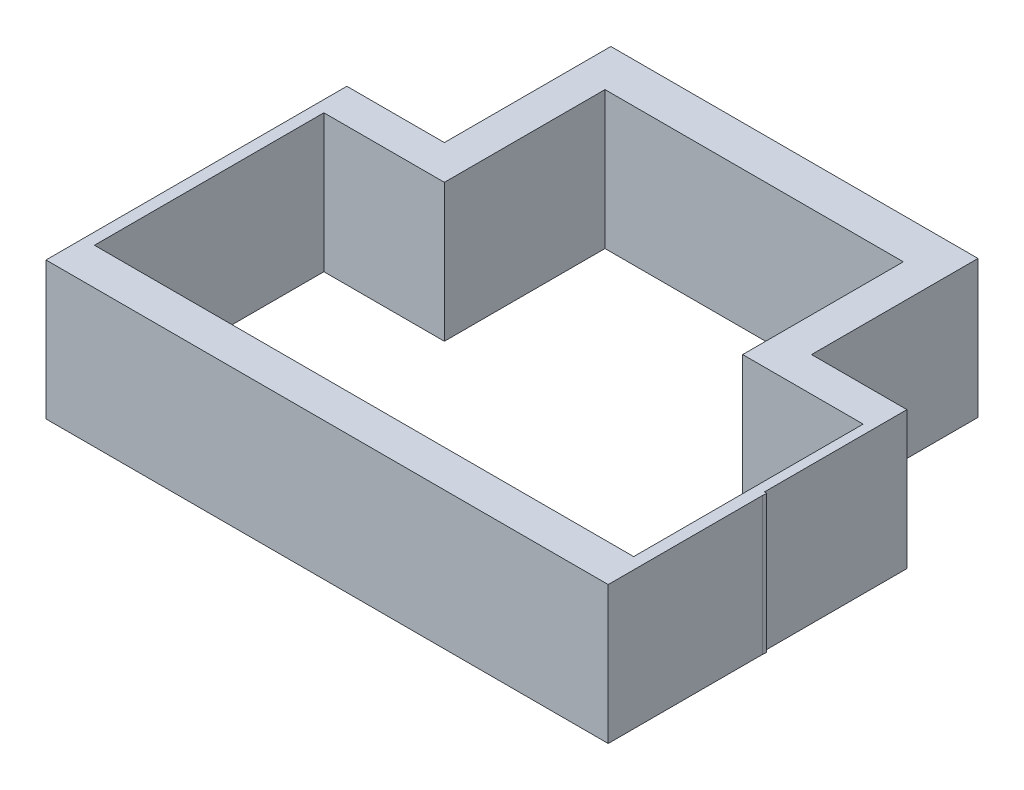
ISO-10303-21;
HEADER;
FILE_DESCRIPTION(('STEP AP214'),'2;1');
FILE_NAME('part.step','',(''),(''),'','','');
FILE_SCHEMA(('AUTOMOTIVE_DESIGN { 1 0 10303 214 1 1 1 1 }'));
ENDSEC;
DATA;
#1=APPLICATION_CONTEXT('core data for automotive mechanical design processes');
#2=APPLICATION_PROTOCOL_DEFINITION('international standard','automotive_design',2000,#1);
#3=PRODUCT_CONTEXT('',#1,'mechanical');
#4=PRODUCT('Part','Part','',(#3));
#5=PRODUCT_RELATED_PRODUCT_CATEGORY('part','',(#4));
#6=PRODUCT_DEFINITION_FORMATION('','',#4);
#7=PRODUCT_DEFINITION_CONTEXT('part definition',#1,'design');
#8=PRODUCT_DEFINITION('design','',#6,#7);
#9=PRODUCT_DEFINITION_SHAPE('','',#8);
#10=(LENGTH_UNIT() NAMED_UNIT(*) SI_UNIT(.MILLI.,.METRE.));
#11=(NAMED_UNIT(*) PLANE_ANGLE_UNIT() SI_UNIT($,.RADIAN.));
#12=(NAMED_UNIT(*) SI_UNIT($,.STERADIAN.) SOLID_ANGLE_UNIT());
#13=UNCERTAINTY_MEASURE_WITH_UNIT(LENGTH_MEASURE(1.E-05),#10,'distance_accuracy_value','');
#14=(GEOMETRIC_REPRESENTATION_CONTEXT(3) GLOBAL_UNCERTAINTY_ASSIGNED_CONTEXT((#13)) GLOBAL_UNIT_ASSIGNED_CONTEXT((#10,
#11,#12)) REPRESENTATION_CONTEXT('',''));
#15=CARTESIAN_POINT('',(0.,0.,0.));
#16=DIRECTION('',(0.,0.,1.));
#17=DIRECTION('',(1.,0.,0.));
#18=AXIS2_PLACEMENT_3D('',#15,#16,#17);
#19=CARTESIAN_POINT('',(8.39631578947368,6.,-10.3557894736842));
#20=DIRECTION('',(-1.,0.,0.));
#21=DIRECTION('',(0.,0.,1.));
#22=AXIS2_PLACEMENT_3D('',#19,#20,#21);
#23=PLANE('',#22);
#24=DIRECTION('',(0.,0.,-1.));
#25=VECTOR('',#24,1.);
#26=CARTESIAN_POINT('',(8.39631578947368,0.,-10.3557894736842));
#27=LINE('',#26,#25);
#28=CARTESIAN_POINT('',(8.39631578947369,0.,2.75473684210526));
#29=VERTEX_POINT('',#28);
#30=CARTESIAN_POINT('',(8.39631578947368,0.,-3.96350702484233));
#31=VERTEX_POINT('',#30);
#32=EDGE_CURVE('E289',#29,#31,#27,.T.);
#33=ORIENTED_EDGE('',*,*,#32,.T.);
#34=DIRECTION('',(0.,-1.,0.));
#35=VECTOR('',#34,1.);
#36=CARTESIAN_POINT('',(8.39631578947368,6.,-3.96350702484233));
#37=LINE('',#36,#35);
#38=CARTESIAN_POINT('',(8.39631578947368,6.,-3.96350702484233));
#39=VERTEX_POINT('',#38);
#40=EDGE_CURVE('E304',#31,#39,#37,.F.);
#41=ORIENTED_EDGE('',*,*,#40,.T.);
#42=DIRECTION('',(0.,0.,-1.));
#43=VECTOR('',#42,1.);
#44=CARTESIAN_POINT('',(8.39631578947368,6.,-10.3557894736842));
#45=LINE('',#44,#43);
#46=CARTESIAN_POINT('',(8.39631578947369,6.,2.75473684210526));
#47=VERTEX_POINT('',#46);
#48=EDGE_CURVE('E279',#47,#39,#45,.T.);
#49=ORIENTED_EDGE('',*,*,#48,.F.);
#50=DIRECTION('',(0.,-1.,0.));
#51=VECTOR('',#50,1.);
#52=CARTESIAN_POINT('',(8.39631578947369,6.,2.75473684210526));
#53=LINE('',#52,#51);
#54=EDGE_CURVE('E295',#47,#29,#53,.T.);
#55=ORIENTED_EDGE('',*,*,#54,.T.);
#56=EDGE_LOOP('',(#33,#41,#49,#55));
#57=FACE_BOUND('',#56,.T.);
#58=ADVANCED_FACE('F35',(#57),#23,.F.);
#59=CARTESIAN_POINT('',(-15.6036842105263,6.,-8.85578947368421));
#60=DIRECTION('',(0.,0.,1.));
#61=DIRECTION('',(1.,0.,0.));
#62=AXIS2_PLACEMENT_3D('',#59,#60,#61);
#63=PLANE('',#62);
#64=DIRECTION('',(0.,-1.,0.));
#65=VECTOR('',#64,1.);
#66=CARTESIAN_POINT('',(-10.3536842105263,6.,-8.85578947368421));
#67=LINE('',#66,#65);
#68=CARTESIAN_POINT('',(-10.3536842105263,6.,-8.85578947368421));
#69=VERTEX_POINT('',#68);
#70=CARTESIAN_POINT('',(-10.3536842105263,0.,-8.85578947368421));
#71=VERTEX_POINT('',#70);
#72=EDGE_CURVE('E301',#69,#71,#67,.T.);
#73=ORIENTED_EDGE('',*,*,#72,.F.);
#74=DIRECTION('',(-1.,0.,0.));
#75=VECTOR('',#74,1.);
#76=CARTESIAN_POINT('',(-15.6036842105263,6.,-8.85578947368421));
#77=LINE('',#76,#75);
#78=CARTESIAN_POINT('',(-15.6036842105263,6.,-8.85578947368421));
#79=VERTEX_POINT('',#78);
#80=EDGE_CURVE('E247',#69,#79,#77,.T.);
#81=ORIENTED_EDGE('',*,*,#80,.T.);
#82=DIRECTION('',(0.,-1.,0.));
#83=VECTOR('',#82,1.);
#84=CARTESIAN_POINT('',(-15.6036842105263,6.,-8.85578947368421));
#85=LINE('',#84,#83);
#86=CARTESIAN_POINT('',(-15.6036842105263,0.,-8.85578947368421));
#87=VERTEX_POINT('',#86);
#88=EDGE_CURVE('E251',#79,#87,#85,.T.);
#89=ORIENTED_EDGE('',*,*,#88,.T.);
#90=DIRECTION('',(-1.,0.,0.));
#91=VECTOR('',#90,1.);
#92=CARTESIAN_POINT('',(-15.6036842105263,0.,-8.85578947368421));
#93=LINE('',#92,#91);
#94=EDGE_CURVE('E260',#71,#87,#93,.T.);
#95=ORIENTED_EDGE('',*,*,#94,.F.);
#96=EDGE_LOOP('',(#73,#81,#89,#95));
#97=FACE_BOUND('',#96,.T.);
#98=ADVANCED_FACE('F342',(#97),#63,.T.);
#99=CARTESIAN_POINT('',(-16.1036842105263,6.,-10.3557894736842));
#100=DIRECTION('',(0.,0.,1.));
#101=DIRECTION('',(1.,0.,0.));
#102=AXIS2_PLACEMENT_3D('',#99,#100,#101);
#103=PLANE('',#102);
#104=DIRECTION('',(-1.,0.,0.));
#105=VECTOR('',#104,1.);
#106=CARTESIAN_POINT('',(-16.1036842105263,6.,-10.3557894736842));
#107=LINE('',#106,#105);
#108=CARTESIAN_POINT('',(8.30338153106238,6.,-10.3557894736842));
#109=VERTEX_POINT('',#108);
#110=CARTESIAN_POINT('',(4.14631578947369,6.,-10.3557894736842));
#111=VERTEX_POINT('',#110);
#112=EDGE_CURVE('E282',#109,#111,#107,.T.);
#113=ORIENTED_EDGE('',*,*,#112,.F.);
#114=DIRECTION('',(0.,-1.,0.));
#115=VECTOR('',#114,1.);
#116=CARTESIAN_POINT('',(8.30338153106238,6.,-10.3557894736842));
#117=LINE('',#116,#115);
#118=CARTESIAN_POINT('',(8.30338153106238,0.,-10.3557894736842));
#119=VERTEX_POINT('',#118);
#120=EDGE_CURVE('E176',#109,#119,#117,.T.);
#121=ORIENTED_EDGE('',*,*,#120,.T.);
#122=DIRECTION('',(-1.,0.,0.));
#123=VECTOR('',#122,1.);
#124=CARTESIAN_POINT('',(-16.1036842105263,0.,-10.3557894736842));
#125=LINE('',#124,#123);
#126=CARTESIAN_POINT('',(4.14631578947369,0.,-10.3557894736842));
#127=VERTEX_POINT('',#126);
#128=EDGE_CURVE('E277',#119,#127,#125,.T.);
#129=ORIENTED_EDGE('',*,*,#128,.T.);
#130=DIRECTION('',(0.,1.,0.));
#131=VECTOR('',#130,1.);
#132=CARTESIAN_POINT('',(4.14631578947369,-17.5677381074786,-10.3557894736842));
#133=LINE('',#132,#131);
#134=EDGE_CURVE('E224',#127,#111,#133,.T.);
#135=ORIENTED_EDGE('',*,*,#134,.T.);
#136=EDGE_LOOP('',(#113,#121,#129,#135));
#137=FACE_BOUND('',#136,.T.);
#138=ADVANCED_FACE('F313',(#137),#103,.F.);
#139=CARTESIAN_POINT('',(0.,6.,0.));
#140=DIRECTION('',(0.,1.,0.));
#141=DIRECTION('',(0.,0.,1.));
#142=AXIS2_PLACEMENT_3D('',#139,#140,#141);
#143=PLANE('',#142);
#144=DIRECTION('',(0.,0.,1.));
#145=VECTOR('',#144,1.);
#146=CARTESIAN_POINT('',(8.30338153106238,6.,-4.14300776404414));
#147=LINE('',#146,#145);
#148=CARTESIAN_POINT('',(8.30338153106238,6.,-4.14300776404414));
#149=VERTEX_POINT('',#148);
#150=EDGE_CURVE('E173',#109,#149,#147,.T.);
#151=ORIENTED_EDGE('',*,*,#150,.F.);
#152=ORIENTED_EDGE('',*,*,#112,.T.);
#153=DIRECTION('',(0.,0.,1.));
#154=VECTOR('',#153,1.);
#155=CARTESIAN_POINT('',(4.14631578947369,6.,0.));
#156=LINE('',#155,#154);
#157=CARTESIAN_POINT('',(4.14631578947369,6.,-17.6101276387379));
#158=VERTEX_POINT('',#157);
#159=EDGE_CURVE('E193',#158,#111,#156,.T.);
#160=ORIENTED_EDGE('',*,*,#159,.F.);
#161=DIRECTION('',(1.,0.,0.));
#162=VECTOR('',#161,1.);
#163=CARTESIAN_POINT('',(0.,6.,-17.6101276387379));
#164=LINE('',#163,#162);
#165=CARTESIAN_POINT('',(-11.8536842105263,6.,-17.6101276387379));
#166=VERTEX_POINT('',#165);
#167=EDGE_CURVE('E210',#166,#158,#164,.T.);
#168=ORIENTED_EDGE('',*,*,#167,.F.);
#169=DIRECTION('',(0.,0.,1.));
#170=VECTOR('',#169,1.);
#171=CARTESIAN_POINT('',(-11.8536842105263,6.,0.));
#172=LINE('',#171,#170);
#173=CARTESIAN_POINT('',(-11.8536842105263,6.,-10.3557894736842));
#174=VERTEX_POINT('',#173);
#175=EDGE_CURVE('E213',#166,#174,#172,.T.);
#176=ORIENTED_EDGE('',*,*,#175,.T.);
#177=CARTESIAN_POINT('',(-16.1036842105263,6.,-10.3557894736842));
#178=VERTEX_POINT('',#177);
#179=EDGE_CURVE('E281',#174,#178,#107,.T.);
#180=ORIENTED_EDGE('',*,*,#179,.T.);
#181=DIRECTION('',(0.,0.,1.));
#182=VECTOR('',#181,1.);
#183=CARTESIAN_POINT('',(-16.1036842105263,6.,-10.3557894736842));
#184=LINE('',#183,#182);
#185=CARTESIAN_POINT('',(-16.1036842105263,6.,2.75473684210526));
#186=VERTEX_POINT('',#185);
#187=EDGE_CURVE('E273',#178,#186,#184,.T.);
#188=ORIENTED_EDGE('',*,*,#187,.T.);
#189=DIRECTION('',(1.,0.,0.));
#190=VECTOR('',#189,1.);
#191=CARTESIAN_POINT('',(-16.1036842105263,6.,2.75473684210526));
#192=LINE('',#191,#190);
#193=EDGE_CURVE('E276',#186,#47,#192,.T.);
#194=ORIENTED_EDGE('',*,*,#193,.T.);
#195=ORIENTED_EDGE('',*,*,#48,.T.);
#196=CARTESIAN_POINT('',(9.89631578947368,6.,-3.96350702484233));
#197=DIRECTION('',(0.,1.,0.));
#198=DIRECTION('',(0.,0.,1.));
#199=AXIS2_PLACEMENT_3D('',#196,#197,#198);
#200=CIRCLE('',#199,1.5);
#201=CARTESIAN_POINT('',(8.40709468949356,6.,-4.14300776404414));
#202=VERTEX_POINT('',#201);
#203=EDGE_CURVE('E185',#39,#202,#200,.F.);
#204=ORIENTED_EDGE('',*,*,#203,.T.);
#205=DIRECTION('',(1.,0.,0.));
#206=VECTOR('',#205,1.);
#207=CARTESIAN_POINT('',(8.30338153106238,6.,-4.14300776404414));
#208=LINE('',#207,#206);
#209=EDGE_CURVE('E50',#149,#202,#208,.T.);
#210=ORIENTED_EDGE('',*,*,#209,.F.);
#211=EDGE_LOOP('',(#151,#152,#160,#168,#176,#180,#188,#194,#195,#204,#210));
#212=FACE_BOUND('',#211,.T.);
#213=DIRECTION('',(0.,0.,1.));
#214=VECTOR('',#213,1.);
#215=CARTESIAN_POINT('',(2.64631578947369,6.,0.));
#216=LINE('',#215,#214);
#217=CARTESIAN_POINT('',(2.64631578947369,6.,-15.8557894736842));
#218=VERTEX_POINT('',#217);
#219=CARTESIAN_POINT('',(2.64631578947369,6.,-8.85578947368421));
#220=VERTEX_POINT('',#219);
#221=EDGE_CURVE('E221',#218,#220,#216,.T.);
#222=ORIENTED_EDGE('',*,*,#221,.T.);
#223=CARTESIAN_POINT('',(7.89631578947368,6.,-8.85578947368421));
#224=VERTEX_POINT('',#223);
#225=EDGE_CURVE('E248',#224,#220,#77,.T.);
#226=ORIENTED_EDGE('',*,*,#225,.F.);
#227=DIRECTION('',(0.,0.,-1.));
#228=VECTOR('',#227,1.);
#229=CARTESIAN_POINT('',(7.89631578947368,6.,1.14421052631579));
#230=LINE('',#229,#228);
#231=CARTESIAN_POINT('',(7.89631578947368,6.,1.14421052631579));
#232=VERTEX_POINT('',#231);
#233=EDGE_CURVE('E244',#232,#224,#230,.T.);
#234=ORIENTED_EDGE('',*,*,#233,.F.);
#235=DIRECTION('',(1.,0.,0.));
#236=VECTOR('',#235,1.);
#237=CARTESIAN_POINT('',(-15.6036842105263,6.,1.14421052631579));
#238=LINE('',#237,#236);
#239=CARTESIAN_POINT('',(-15.6036842105263,6.,1.14421052631579));
#240=VERTEX_POINT('',#239);
#241=EDGE_CURVE('E241',#240,#232,#238,.T.);
#242=ORIENTED_EDGE('',*,*,#241,.F.);
#243=DIRECTION('',(0.,0.,1.));
#244=VECTOR('',#243,1.);
#245=CARTESIAN_POINT('',(-15.6036842105263,6.,1.14421052631579));
#246=LINE('',#245,#244);
#247=EDGE_CURVE('E239',#79,#240,#246,.T.);
#248=ORIENTED_EDGE('',*,*,#247,.F.);
#249=ORIENTED_EDGE('',*,*,#80,.F.);
#250=DIRECTION('',(0.,0.,1.));
#251=VECTOR('',#250,1.);
#252=CARTESIAN_POINT('',(-10.3536842105263,6.,0.));
#253=LINE('',#252,#251);
#254=CARTESIAN_POINT('',(-10.3536842105263,6.,-15.8557894736842));
#255=VERTEX_POINT('',#254);
#256=EDGE_CURVE('E216',#255,#69,#253,.T.);
#257=ORIENTED_EDGE('',*,*,#256,.F.);
#258=DIRECTION('',(1.,0.,0.));
#259=VECTOR('',#258,1.);
#260=CARTESIAN_POINT('',(0.,6.,-15.8557894736842));
#261=LINE('',#260,#259);
#262=EDGE_CURVE('E218',#255,#218,#261,.T.);
#263=ORIENTED_EDGE('',*,*,#262,.T.);
#264=EDGE_LOOP('',(#222,#226,#234,#242,#248,#249,#257,#263));
#265=FACE_BOUND('',#264,.T.);
#266=ADVANCED_FACE('F181',(#212,#265),#143,.T.);
#267=CARTESIAN_POINT('',(0.,0.,0.));
#268=DIRECTION('',(0.,1.,0.));
#269=DIRECTION('',(0.,0.,1.));
#270=AXIS2_PLACEMENT_3D('',#267,#268,#269);
#271=PLANE('',#270);
#272=CARTESIAN_POINT('',(7.89631578947368,0.,-8.85578947368421));
#273=VERTEX_POINT('',#272);
#274=CARTESIAN_POINT('',(2.64631578947369,0.,-8.85578947368421));
#275=VERTEX_POINT('',#274);
#276=EDGE_CURVE('E242',#273,#275,#93,.T.);
#277=ORIENTED_EDGE('',*,*,#276,.T.);
#278=DIRECTION('',(0.,0.,-1.));
#279=VECTOR('',#278,1.);
#280=CARTESIAN_POINT('',(2.64631578947369,0.,0.));
#281=LINE('',#280,#279);
#282=CARTESIAN_POINT('',(2.64631578947369,0.,-15.8557894736842));
#283=VERTEX_POINT('',#282);
#284=EDGE_CURVE('E202',#275,#283,#281,.T.);
#285=ORIENTED_EDGE('',*,*,#284,.T.);
#286=DIRECTION('',(-1.,0.,0.));
#287=VECTOR('',#286,1.);
#288=CARTESIAN_POINT('',(0.,0.,-15.8557894736842));
#289=LINE('',#288,#287);
#290=CARTESIAN_POINT('',(-10.3536842105263,0.,-15.8557894736842));
#291=VERTEX_POINT('',#290);
#292=EDGE_CURVE('E199',#283,#291,#289,.T.);
#293=ORIENTED_EDGE('',*,*,#292,.T.);
#294=DIRECTION('',(0.,0.,-1.));
#295=VECTOR('',#294,1.);
#296=CARTESIAN_POINT('',(-10.3536842105263,0.,0.));
#297=LINE('',#296,#295);
#298=EDGE_CURVE('E196',#71,#291,#297,.T.);
#299=ORIENTED_EDGE('',*,*,#298,.F.);
#300=ORIENTED_EDGE('',*,*,#94,.T.);
#301=DIRECTION('',(0.,0.,1.));
#302=VECTOR('',#301,1.);
#303=CARTESIAN_POINT('',(-15.6036842105263,0.,1.14421052631579));
#304=LINE('',#303,#302);
#305=CARTESIAN_POINT('',(-15.6036842105263,0.,1.14421052631579));
#306=VERTEX_POINT('',#305);
#307=EDGE_CURVE('E207',#87,#306,#304,.T.);
#308=ORIENTED_EDGE('',*,*,#307,.T.);
#309=DIRECTION('',(1.,0.,0.));
#310=VECTOR('',#309,1.);
#311=CARTESIAN_POINT('',(-15.6036842105263,0.,1.14421052631579));
#312=LINE('',#311,#310);
#313=CARTESIAN_POINT('',(7.89631578947368,0.,1.14421052631579));
#314=VERTEX_POINT('',#313);
#315=EDGE_CURVE('E254',#306,#314,#312,.T.);
#316=ORIENTED_EDGE('',*,*,#315,.T.);
#317=DIRECTION('',(0.,0.,-1.));
#318=VECTOR('',#317,1.);
#319=CARTESIAN_POINT('',(7.89631578947368,0.,1.14421052631579));
#320=LINE('',#319,#318);
#321=EDGE_CURVE('E257',#314,#273,#320,.T.);
#322=ORIENTED_EDGE('',*,*,#321,.T.);
#323=EDGE_LOOP('',(#277,#285,#293,#299,#300,#308,#316,#322));
#324=FACE_BOUND('',#323,.T.);
#325=ORIENTED_EDGE('',*,*,#128,.F.);
#326=DIRECTION('',(0.,0.,1.));
#327=VECTOR('',#326,1.);
#328=CARTESIAN_POINT('',(8.30338153106238,0.,0.));
#329=LINE('',#328,#327);
#330=CARTESIAN_POINT('',(8.30338153106238,0.,-4.14300776404414));
#331=VERTEX_POINT('',#330);
#332=EDGE_CURVE('E11',#119,#331,#329,.T.);
#333=ORIENTED_EDGE('',*,*,#332,.T.);
#334=DIRECTION('',(1.,0.,0.));
#335=VECTOR('',#334,1.);
#336=CARTESIAN_POINT('',(0.,0.,-4.14300776404414));
#337=LINE('',#336,#335);
#338=CARTESIAN_POINT('',(8.40709468949356,0.,-4.14300776404414));
#339=VERTEX_POINT('',#338);
#340=EDGE_CURVE('E169',#331,#339,#337,.T.);
#341=ORIENTED_EDGE('',*,*,#340,.T.);
#342=CARTESIAN_POINT('',(9.89631578947368,0.,-3.96350702484233));
#343=DIRECTION('',(0.,1.,0.));
#344=DIRECTION('',(0.,0.,1.));
#345=AXIS2_PLACEMENT_3D('',#342,#343,#344);
#346=CIRCLE('',#345,1.5);
#347=EDGE_CURVE('E58',#339,#31,#346,.T.);
#348=ORIENTED_EDGE('',*,*,#347,.T.);
#349=ORIENTED_EDGE('',*,*,#32,.F.);
#350=DIRECTION('',(1.,0.,0.));
#351=VECTOR('',#350,1.);
#352=CARTESIAN_POINT('',(-16.1036842105263,0.,2.75473684210526));
#353=LINE('',#352,#351);
#354=CARTESIAN_POINT('',(-16.1036842105263,0.,2.75473684210526));
#355=VERTEX_POINT('',#354);
#356=EDGE_CURVE('E287',#355,#29,#353,.T.);
#357=ORIENTED_EDGE('',*,*,#356,.F.);
#358=DIRECTION('',(0.,0.,1.));
#359=VECTOR('',#358,1.);
#360=CARTESIAN_POINT('',(-16.1036842105263,0.,-10.3557894736842));
#361=LINE('',#360,#359);
#362=CARTESIAN_POINT('',(-16.1036842105263,0.,-10.3557894736842));
#363=VERTEX_POINT('',#362);
#364=EDGE_CURVE('E272',#363,#355,#361,.T.);
#365=ORIENTED_EDGE('',*,*,#364,.F.);
#366=CARTESIAN_POINT('',(-11.8536842105263,0.,-10.3557894736842));
#367=VERTEX_POINT('',#366);
#368=EDGE_CURVE('E291',#367,#363,#125,.T.);
#369=ORIENTED_EDGE('',*,*,#368,.F.);
#370=DIRECTION('',(0.,0.,-1.));
#371=VECTOR('',#370,1.);
#372=CARTESIAN_POINT('',(-11.8536842105263,0.,0.));
#373=LINE('',#372,#371);
#374=CARTESIAN_POINT('',(-11.8536842105263,0.,-17.6101276387379));
#375=VERTEX_POINT('',#374);
#376=EDGE_CURVE('E194',#367,#375,#373,.T.);
#377=ORIENTED_EDGE('',*,*,#376,.T.);
#378=DIRECTION('',(-1.,0.,0.));
#379=VECTOR('',#378,1.);
#380=CARTESIAN_POINT('',(0.,0.,-17.6101276387379));
#381=LINE('',#380,#379);
#382=CARTESIAN_POINT('',(4.14631578947369,0.,-17.6101276387379));
#383=VERTEX_POINT('',#382);
#384=EDGE_CURVE('E197',#383,#375,#381,.T.);
#385=ORIENTED_EDGE('',*,*,#384,.F.);
#386=DIRECTION('',(0.,0.,-1.));
#387=VECTOR('',#386,1.);
#388=CARTESIAN_POINT('',(4.14631578947369,0.,0.));
#389=LINE('',#388,#387);
#390=EDGE_CURVE('E204',#127,#383,#389,.T.);
#391=ORIENTED_EDGE('',*,*,#390,.F.);
#392=EDGE_LOOP('',(#325,#333,#341,#348,#349,#357,#365,#369,#377,#385,#391));
#393=FACE_BOUND('',#392,.T.);
#394=ADVANCED_FACE('F310',(#324,#393),#271,.F.);
#395=CARTESIAN_POINT('',(-16.1036842105263,6.,-10.3557894736842));
#396=DIRECTION('',(1.,0.,0.));
#397=DIRECTION('',(0.,0.,-1.));
#398=AXIS2_PLACEMENT_3D('',#395,#396,#397);
#399=PLANE('',#398);
#400=ORIENTED_EDGE('',*,*,#364,.T.);
#401=DIRECTION('',(0.,-1.,0.));
#402=VECTOR('',#401,1.);
#403=CARTESIAN_POINT('',(-16.1036842105263,6.,2.75473684210526));
#404=LINE('',#403,#402);
#405=EDGE_CURVE('E298',#186,#355,#404,.T.);
#406=ORIENTED_EDGE('',*,*,#405,.F.);
#407=ORIENTED_EDGE('',*,*,#187,.F.);
#408=DIRECTION('',(0.,-1.,0.));
#409=VECTOR('',#408,1.);
#410=CARTESIAN_POINT('',(-16.1036842105263,6.,-10.3557894736842));
#411=LINE('',#410,#409);
#412=EDGE_CURVE('E284',#178,#363,#411,.T.);
#413=ORIENTED_EDGE('',*,*,#412,.T.);
#414=EDGE_LOOP('',(#400,#406,#407,#413));
#415=FACE_BOUND('',#414,.T.);
#416=ADVANCED_FACE('F335',(#415),#399,.F.);
#417=CARTESIAN_POINT('',(-16.1036842105263,6.,2.75473684210526));
#418=DIRECTION('',(0.,0.,-1.));
#419=DIRECTION('',(-1.,0.,0.));
#420=AXIS2_PLACEMENT_3D('',#417,#418,#419);
#421=PLANE('',#420);
#422=ORIENTED_EDGE('',*,*,#356,.T.);
#423=ORIENTED_EDGE('',*,*,#54,.F.);
#424=ORIENTED_EDGE('',*,*,#193,.F.);
#425=ORIENTED_EDGE('',*,*,#405,.T.);
#426=EDGE_LOOP('',(#422,#423,#424,#425));
#427=FACE_BOUND('',#426,.T.);
#428=ADVANCED_FACE('F337',(#427),#421,.F.);
#429=ORIENTED_EDGE('',*,*,#179,.F.);
#430=DIRECTION('',(0.,1.,0.));
#431=VECTOR('',#430,1.);
#432=CARTESIAN_POINT('',(-11.8536842105263,-17.5677381074786,-10.3557894736842));
#433=LINE('',#432,#431);
#434=EDGE_CURVE('E231',#367,#174,#433,.T.);
#435=ORIENTED_EDGE('',*,*,#434,.F.);
#436=ORIENTED_EDGE('',*,*,#368,.T.);
#437=ORIENTED_EDGE('',*,*,#412,.F.);
#438=EDGE_LOOP('',(#429,#435,#436,#437));
#439=FACE_BOUND('',#438,.T.);
#440=ADVANCED_FACE('F332',(#439),#103,.F.);
#441=CARTESIAN_POINT('',(-15.6036842105263,6.,1.14421052631579));
#442=DIRECTION('',(1.,0.,0.));
#443=DIRECTION('',(0.,0.,-1.));
#444=AXIS2_PLACEMENT_3D('',#441,#442,#443);
#445=PLANE('',#444);
#446=ORIENTED_EDGE('',*,*,#307,.F.);
#447=ORIENTED_EDGE('',*,*,#88,.F.);
#448=ORIENTED_EDGE('',*,*,#247,.T.);
#449=DIRECTION('',(0.,-1.,0.));
#450=VECTOR('',#449,1.);
#451=CARTESIAN_POINT('',(-15.6036842105263,6.,1.14421052631579));
#452=LINE('',#451,#450);
#453=EDGE_CURVE('E269',#240,#306,#452,.T.);
#454=ORIENTED_EDGE('',*,*,#453,.T.);
#455=EDGE_LOOP('',(#446,#447,#448,#454));
#456=FACE_BOUND('',#455,.T.);
#457=ADVANCED_FACE('F364',(#456),#445,.T.);
#458=CARTESIAN_POINT('',(-15.6036842105263,6.,1.14421052631579));
#459=DIRECTION('',(0.,0.,-1.));
#460=DIRECTION('',(-1.,0.,0.));
#461=AXIS2_PLACEMENT_3D('',#458,#459,#460);
#462=PLANE('',#461);
#463=ORIENTED_EDGE('',*,*,#315,.F.);
#464=ORIENTED_EDGE('',*,*,#453,.F.);
#465=ORIENTED_EDGE('',*,*,#241,.T.);
#466=DIRECTION('',(0.,-1.,0.));
#467=VECTOR('',#466,1.);
#468=CARTESIAN_POINT('',(7.89631578947368,6.,1.14421052631579));
#469=LINE('',#468,#467);
#470=EDGE_CURVE('E267',#232,#314,#469,.T.);
#471=ORIENTED_EDGE('',*,*,#470,.T.);
#472=EDGE_LOOP('',(#463,#464,#465,#471));
#473=FACE_BOUND('',#472,.T.);
#474=ADVANCED_FACE('F367',(#473),#462,.T.);
#475=CARTESIAN_POINT('',(7.89631578947368,6.,1.14421052631579));
#476=DIRECTION('',(-1.,0.,0.));
#477=DIRECTION('',(0.,0.,1.));
#478=AXIS2_PLACEMENT_3D('',#475,#476,#477);
#479=PLANE('',#478);
#480=ORIENTED_EDGE('',*,*,#321,.F.);
#481=ORIENTED_EDGE('',*,*,#470,.F.);
#482=ORIENTED_EDGE('',*,*,#233,.T.);
#483=DIRECTION('',(0.,-1.,0.));
#484=VECTOR('',#483,1.);
#485=CARTESIAN_POINT('',(7.89631578947368,6.,-8.85578947368421));
#486=LINE('',#485,#484);
#487=EDGE_CURVE('E265',#224,#273,#486,.T.);
#488=ORIENTED_EDGE('',*,*,#487,.T.);
#489=EDGE_LOOP('',(#480,#481,#482,#488));
#490=FACE_BOUND('',#489,.T.);
#491=ADVANCED_FACE('F371',(#490),#479,.T.);
#492=ORIENTED_EDGE('',*,*,#225,.T.);
#493=DIRECTION('',(0.,1.,0.));
#494=VECTOR('',#493,1.);
#495=CARTESIAN_POINT('',(2.64631578947369,-2.69492034817274,-8.85578947368421));
#496=LINE('',#495,#494);
#497=EDGE_CURVE('E190',#275,#220,#496,.T.);
#498=ORIENTED_EDGE('',*,*,#497,.F.);
#499=ORIENTED_EDGE('',*,*,#276,.F.);
#500=ORIENTED_EDGE('',*,*,#487,.F.);
#501=EDGE_LOOP('',(#492,#498,#499,#500));
#502=FACE_BOUND('',#501,.T.);
#503=ADVANCED_FACE('F349',(#502),#63,.T.);
#504=CARTESIAN_POINT('',(0.,-17.5677381074786,-17.6101276387379));
#505=DIRECTION('',(0.,0.,1.));
#506=DIRECTION('',(1.,0.,0.));
#507=AXIS2_PLACEMENT_3D('',#504,#505,#506);
#508=PLANE('',#507);
#509=DIRECTION('',(0.,1.,0.));
#510=VECTOR('',#509,1.);
#511=CARTESIAN_POINT('',(4.14631578947369,-17.5677381074786,-17.6101276387379));
#512=LINE('',#511,#510);
#513=EDGE_CURVE('E223',#383,#158,#512,.T.);
#514=ORIENTED_EDGE('',*,*,#513,.F.);
#515=ORIENTED_EDGE('',*,*,#384,.T.);
#516=DIRECTION('',(0.,1.,0.));
#517=VECTOR('',#516,1.);
#518=CARTESIAN_POINT('',(-11.8536842105263,-17.5677381074786,-17.6101276387379));
#519=LINE('',#518,#517);
#520=EDGE_CURVE('E234',#375,#166,#519,.T.);
#521=ORIENTED_EDGE('',*,*,#520,.T.);
#522=ORIENTED_EDGE('',*,*,#167,.T.);
#523=EDGE_LOOP('',(#514,#515,#521,#522));
#524=FACE_BOUND('',#523,.T.);
#525=ADVANCED_FACE('F322',(#524),#508,.F.);
#526=CARTESIAN_POINT('',(-11.8536842105263,-17.5677381074786,0.));
#527=DIRECTION('',(-1.,0.,0.));
#528=DIRECTION('',(0.,0.,1.));
#529=AXIS2_PLACEMENT_3D('',#526,#527,#528);
#530=PLANE('',#529);
#531=ORIENTED_EDGE('',*,*,#376,.F.);
#532=ORIENTED_EDGE('',*,*,#434,.T.);
#533=ORIENTED_EDGE('',*,*,#175,.F.);
#534=ORIENTED_EDGE('',*,*,#520,.F.);
#535=EDGE_LOOP('',(#531,#532,#533,#534));
#536=FACE_BOUND('',#535,.T.);
#537=ADVANCED_FACE('F326',(#536),#530,.T.);
#538=CARTESIAN_POINT('',(-10.3536842105263,-17.5677381074786,0.));
#539=DIRECTION('',(-1.,0.,0.));
#540=DIRECTION('',(0.,0.,1.));
#541=AXIS2_PLACEMENT_3D('',#538,#539,#540);
#542=PLANE('',#541);
#543=ORIENTED_EDGE('',*,*,#256,.T.);
#544=ORIENTED_EDGE('',*,*,#72,.T.);
#545=ORIENTED_EDGE('',*,*,#298,.T.);
#546=DIRECTION('',(0.,1.,0.));
#547=VECTOR('',#546,1.);
#548=CARTESIAN_POINT('',(-10.3536842105263,-17.5677381074786,-15.8557894736842));
#549=LINE('',#548,#547);
#550=EDGE_CURVE('E229',#291,#255,#549,.T.);
#551=ORIENTED_EDGE('',*,*,#550,.T.);
#552=EDGE_LOOP('',(#543,#544,#545,#551));
#553=FACE_BOUND('',#552,.T.);
#554=ADVANCED_FACE('F385',(#553),#542,.F.);
#555=CARTESIAN_POINT('',(0.,-17.5677381074786,-15.8557894736842));
#556=DIRECTION('',(0.,0.,1.));
#557=DIRECTION('',(1.,0.,0.));
#558=AXIS2_PLACEMENT_3D('',#555,#556,#557);
#559=PLANE('',#558);
#560=ORIENTED_EDGE('',*,*,#292,.F.);
#561=DIRECTION('',(0.,1.,0.));
#562=VECTOR('',#561,1.);
#563=CARTESIAN_POINT('',(2.64631578947369,-17.5677381074786,-15.8557894736842));
#564=LINE('',#563,#562);
#565=EDGE_CURVE('E227',#283,#218,#564,.T.);
#566=ORIENTED_EDGE('',*,*,#565,.T.);
#567=ORIENTED_EDGE('',*,*,#262,.F.);
#568=ORIENTED_EDGE('',*,*,#550,.F.);
#569=EDGE_LOOP('',(#560,#566,#567,#568));
#570=FACE_BOUND('',#569,.T.);
#571=ADVANCED_FACE('F388',(#570),#559,.T.);
#572=CARTESIAN_POINT('',(2.64631578947369,-17.5677381074786,0.));
#573=DIRECTION('',(-1.,0.,0.));
#574=DIRECTION('',(0.,0.,1.));
#575=AXIS2_PLACEMENT_3D('',#572,#573,#574);
#576=PLANE('',#575);
#577=ORIENTED_EDGE('',*,*,#284,.F.);
#578=ORIENTED_EDGE('',*,*,#497,.T.);
#579=ORIENTED_EDGE('',*,*,#221,.F.);
#580=ORIENTED_EDGE('',*,*,#565,.F.);
#581=EDGE_LOOP('',(#577,#578,#579,#580));
#582=FACE_BOUND('',#581,.T.);
#583=ADVANCED_FACE('F380',(#582),#576,.T.);
#584=CARTESIAN_POINT('',(4.14631578947369,-17.5677381074786,0.));
#585=DIRECTION('',(-1.,0.,0.));
#586=DIRECTION('',(0.,0.,1.));
#587=AXIS2_PLACEMENT_3D('',#584,#585,#586);
#588=PLANE('',#587);
#589=ORIENTED_EDGE('',*,*,#134,.F.);
#590=ORIENTED_EDGE('',*,*,#390,.T.);
#591=ORIENTED_EDGE('',*,*,#513,.T.);
#592=ORIENTED_EDGE('',*,*,#159,.T.);
#593=EDGE_LOOP('',(#589,#590,#591,#592));
#594=FACE_BOUND('',#593,.T.);
#595=ADVANCED_FACE('F319',(#594),#588,.F.);
#596=CARTESIAN_POINT('',(9.89631578947368,6.,-3.96350702484233));
#597=DIRECTION('',(0.,1.,0.));
#598=DIRECTION('',(0.,0.,1.));
#599=AXIS2_PLACEMENT_3D('',#596,#597,#598);
#600=CYLINDRICAL_SURFACE('',#599,1.5);
#601=ORIENTED_EDGE('',*,*,#347,.F.);
#602=DIRECTION('',(0.,1.,0.));
#603=VECTOR('',#602,1.);
#604=CARTESIAN_POINT('',(8.40709468949356,6.,-4.14300776404414));
#605=LINE('',#604,#603);
#606=EDGE_CURVE('E43',#339,#202,#605,.T.);
#607=ORIENTED_EDGE('',*,*,#606,.T.);
#608=ORIENTED_EDGE('',*,*,#203,.F.);
#609=ORIENTED_EDGE('',*,*,#40,.F.);
#610=EDGE_LOOP('',(#601,#607,#608,#609));
#611=FACE_BOUND('',#610,.T.);
#612=ADVANCED_FACE('F37',(#611),#600,.F.);
#613=CARTESIAN_POINT('',(8.30338153106238,-4.,-4.14300776404414));
#614=DIRECTION('',(-1.,0.,0.));
#615=DIRECTION('',(0.,0.,1.));
#616=AXIS2_PLACEMENT_3D('',#613,#614,#615);
#617=PLANE('',#616);
#618=ORIENTED_EDGE('',*,*,#150,.T.);
#619=DIRECTION('',(0.,1.,0.));
#620=VECTOR('',#619,1.);
#621=CARTESIAN_POINT('',(8.30338153106238,-4.,-4.14300776404414));
#622=LINE('',#621,#620);
#623=EDGE_CURVE('E166',#331,#149,#622,.T.);
#624=ORIENTED_EDGE('',*,*,#623,.F.);
#625=ORIENTED_EDGE('',*,*,#332,.F.);
#626=ORIENTED_EDGE('',*,*,#120,.F.);
#627=EDGE_LOOP('',(#618,#624,#625,#626));
#628=FACE_BOUND('',#627,.T.);
#629=ADVANCED_FACE('F174',(#628),#617,.F.);
#630=CARTESIAN_POINT('',(8.30338153106238,-4.,-4.14300776404414));
#631=DIRECTION('',(0.,0.,1.));
#632=DIRECTION('',(1.,0.,0.));
#633=AXIS2_PLACEMENT_3D('',#630,#631,#632);
#634=PLANE('',#633);
#635=ORIENTED_EDGE('',*,*,#623,.T.);
#636=ORIENTED_EDGE('',*,*,#209,.T.);
#637=ORIENTED_EDGE('',*,*,#606,.F.);
#638=ORIENTED_EDGE('',*,*,#340,.F.);
#639=EDGE_LOOP('',(#635,#636,#637,#638));
#640=FACE_BOUND('',#639,.T.);
#641=ADVANCED_FACE('F168',(#640),#634,.F.);
#642=CLOSED_SHELL('',(#58,#98,#138,#266,#394,#416,#428,#440,#457,#474,#491,#503,#525,#537,#554,
#571,#583,#595,#612,#629,#641));
#643=MANIFOLD_SOLID_BREP('B2',#642);
#644=ADVANCED_BREP_SHAPE_REPRESENTATION('',(#18,#643),#14);
#645=SHAPE_DEFINITION_REPRESENTATION(#9,#644);
ENDSEC;
END-ISO-10303-21;
